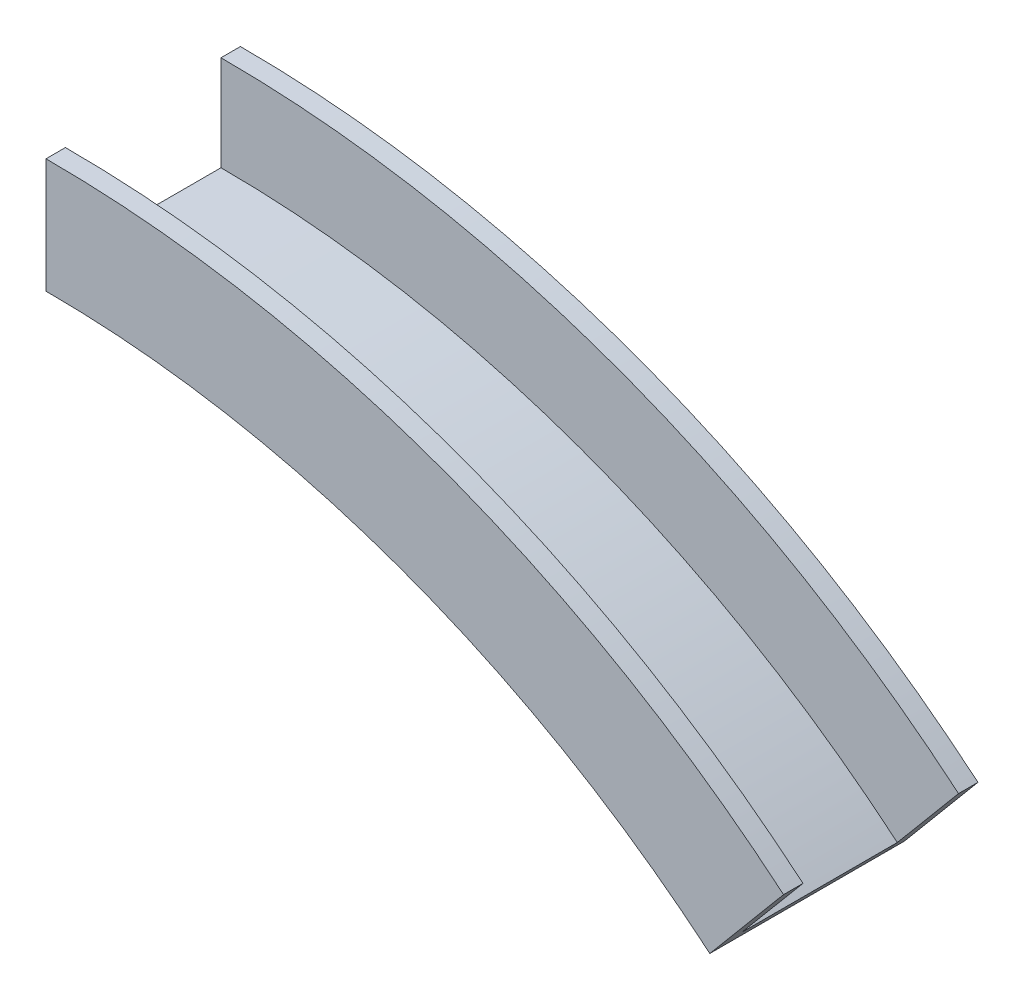
ISO-10303-21;
HEADER;
FILE_DESCRIPTION(('STEP AP214'),'2;1');
FILE_NAME('part.step','',(''),(''),'','','');
FILE_SCHEMA(('AUTOMOTIVE_DESIGN { 1 0 10303 214 1 1 1 1 }'));
ENDSEC;
DATA;
#1=APPLICATION_CONTEXT('core data for automotive mechanical design processes');
#2=APPLICATION_PROTOCOL_DEFINITION('international standard','automotive_design',2000,#1);
#3=PRODUCT_CONTEXT('',#1,'mechanical');
#4=PRODUCT('Part','Part','',(#3));
#5=PRODUCT_RELATED_PRODUCT_CATEGORY('part','',(#4));
#6=PRODUCT_DEFINITION_FORMATION('','',#4);
#7=PRODUCT_DEFINITION_CONTEXT('part definition',#1,'design');
#8=PRODUCT_DEFINITION('design','',#6,#7);
#9=PRODUCT_DEFINITION_SHAPE('','',#8);
#10=(LENGTH_UNIT() NAMED_UNIT(*) SI_UNIT(.MILLI.,.METRE.));
#11=(NAMED_UNIT(*) PLANE_ANGLE_UNIT() SI_UNIT($,.RADIAN.));
#12=(NAMED_UNIT(*) SI_UNIT($,.STERADIAN.) SOLID_ANGLE_UNIT());
#13=UNCERTAINTY_MEASURE_WITH_UNIT(LENGTH_MEASURE(1.E-05),#10,'distance_accuracy_value','');
#14=(GEOMETRIC_REPRESENTATION_CONTEXT(3) GLOBAL_UNCERTAINTY_ASSIGNED_CONTEXT((#13)) GLOBAL_UNIT_ASSIGNED_CONTEXT((#10,
#11,#12)) REPRESENTATION_CONTEXT('',''));
#15=CARTESIAN_POINT('',(0.,0.,0.));
#16=DIRECTION('',(0.,0.,1.));
#17=DIRECTION('',(1.,0.,0.));
#18=AXIS2_PLACEMENT_3D('',#15,#16,#17);
#19=CARTESIAN_POINT('',(0.,0.,3.175));
#20=DIRECTION('',(0.,0.,1.));
#21=DIRECTION('',(1.,0.,0.));
#22=AXIS2_PLACEMENT_3D('',#19,#20,#21);
#23=PLANE('',#22);
#24=CARTESIAN_POINT('',(0.,0.,3.175));
#25=DIRECTION('',(0.,0.,1.));
#26=DIRECTION('',(1.,0.,0.));
#27=AXIS2_PLACEMENT_3D('',#24,#25,#26);
#28=CIRCLE('',#27,168.656);
#29=CARTESIAN_POINT('',(108.409987099295,129.197991598673,3.175));
#30=VERTEX_POINT('',#29);
#31=CARTESIAN_POINT('',(0.,168.656,3.175));
#32=VERTEX_POINT('',#31);
#33=EDGE_CURVE('E88',#30,#32,#28,.T.);
#34=ORIENTED_EDGE('',*,*,#33,.F.);
#35=DIRECTION('',(0.642787609686557,0.766044443118963,0.));
#36=VECTOR('',#35,1.);
#37=CARTESIAN_POINT('',(-8.39849176403869E-13,7.04717134165062E-13,3.175));
#38=LINE('',#37,#36);
#39=CARTESIAN_POINT('',(120.451005997749,143.547919129398,3.175));
#40=VERTEX_POINT('',#39);
#41=EDGE_CURVE('E91',#30,#40,#38,.T.);
#42=ORIENTED_EDGE('',*,*,#41,.T.);
#43=CARTESIAN_POINT('',(0.,0.,3.175));
#44=DIRECTION('',(0.,0.,1.));
#45=DIRECTION('',(1.,0.,0.));
#46=AXIS2_PLACEMENT_3D('',#43,#44,#45);
#47=CIRCLE('',#46,187.3885);
#48=CARTESIAN_POINT('',(0.,187.3885,3.175));
#49=VERTEX_POINT('',#48);
#50=EDGE_CURVE('E66',#40,#49,#47,.T.);
#51=ORIENTED_EDGE('',*,*,#50,.T.);
#52=DIRECTION('',(0.,1.,0.));
#53=VECTOR('',#52,1.);
#54=CARTESIAN_POINT('',(0.,0.,3.175));
#55=LINE('',#54,#53);
#56=EDGE_CURVE('E86',#32,#49,#55,.T.);
#57=ORIENTED_EDGE('',*,*,#56,.F.);
#58=EDGE_LOOP('',(#34,#42,#51,#57));
#59=FACE_BOUND('',#58,.T.);
#60=ADVANCED_FACE('F44',(#59),#23,.T.);
#61=CARTESIAN_POINT('',(0.,49.6794513874194,-0.01));
#62=DIRECTION('',(1.,0.,0.));
#63=DIRECTION('',(0.,1.,0.));
#64=AXIS2_PLACEMENT_3D('',#61,#62,#63);
#65=PLANE('',#64);
#66=DIRECTION('',(0.,0.,-1.));
#67=VECTOR('',#66,1.);
#68=CARTESIAN_POINT('',(0.,168.656,3.175));
#69=LINE('',#68,#67);
#70=CARTESIAN_POINT('',(0.,168.656,0.));
#71=VERTEX_POINT('',#70);
#72=EDGE_CURVE('E12',#71,#32,#69,.F.);
#73=ORIENTED_EDGE('',*,*,#72,.T.);
#74=ORIENTED_EDGE('',*,*,#56,.T.);
#75=DIRECTION('',(0.,0.,-1.));
#76=VECTOR('',#75,1.);
#77=CARTESIAN_POINT('',(0.,187.3885,3.175));
#78=LINE('',#77,#76);
#79=CARTESIAN_POINT('',(0.,187.3885,0.));
#80=VERTEX_POINT('',#79);
#81=EDGE_CURVE('E122',#80,#49,#78,.F.);
#82=ORIENTED_EDGE('',*,*,#81,.F.);
#83=DIRECTION('',(0.,1.,0.));
#84=VECTOR('',#83,1.);
#85=CARTESIAN_POINT('',(0.,0.,0.));
#86=LINE('',#85,#84);
#87=EDGE_CURVE('E58',#71,#80,#86,.T.);
#88=ORIENTED_EDGE('',*,*,#87,.F.);
#89=EDGE_LOOP('',(#73,#74,#82,#88));
#90=FACE_BOUND('',#89,.T.);
#91=ADVANCED_FACE('F99',(#90),#65,.F.);
#92=CARTESIAN_POINT('',(0.,0.,0.));
#93=DIRECTION('',(0.,0.,1.));
#94=DIRECTION('',(1.,0.,0.));
#95=AXIS2_PLACEMENT_3D('',#92,#93,#94);
#96=PLANE('',#95);
#97=DIRECTION('',(0.642787609686557,0.766044443118963,0.));
#98=VECTOR('',#97,1.);
#99=CARTESIAN_POINT('',(-8.39849176403869E-13,7.04717134165062E-13,0.));
#100=LINE('',#99,#98);
#101=CARTESIAN_POINT('',(108.409987099295,129.197991598673,0.));
#102=VERTEX_POINT('',#101);
#103=CARTESIAN_POINT('',(120.451005997749,143.547919129398,0.));
#104=VERTEX_POINT('',#103);
#105=EDGE_CURVE('E90',#102,#104,#100,.T.);
#106=ORIENTED_EDGE('',*,*,#105,.F.);
#107=CARTESIAN_POINT('',(0.,0.,0.));
#108=DIRECTION('',(0.,0.,1.));
#109=DIRECTION('',(1.,0.,0.));
#110=AXIS2_PLACEMENT_3D('',#107,#108,#109);
#111=CIRCLE('',#110,168.656);
#112=EDGE_CURVE('E97',#102,#71,#111,.T.);
#113=ORIENTED_EDGE('',*,*,#112,.T.);
#114=ORIENTED_EDGE('',*,*,#87,.T.);
#115=CARTESIAN_POINT('',(0.,0.,0.));
#116=DIRECTION('',(0.,0.,1.));
#117=DIRECTION('',(1.,0.,0.));
#118=AXIS2_PLACEMENT_3D('',#115,#116,#117);
#119=CIRCLE('',#118,187.3885);
#120=EDGE_CURVE('E126',#104,#80,#119,.T.);
#121=ORIENTED_EDGE('',*,*,#120,.F.);
#122=EDGE_LOOP('',(#106,#113,#114,#121));
#123=FACE_BOUND('',#122,.T.);
#124=ADVANCED_FACE('F101',(#123),#96,.F.);
#125=CARTESIAN_POINT('',(31.933335807858,38.056667672532,-0.01));
#126=DIRECTION('',(0.766044443118963,-0.642787609686557,0.));
#127=DIRECTION('',(0.642787609686557,0.766044443118963,0.));
#128=AXIS2_PLACEMENT_3D('',#125,#126,#127);
#129=PLANE('',#128);
#130=ORIENTED_EDGE('',*,*,#41,.F.);
#131=DIRECTION('',(0.,0.,-1.));
#132=VECTOR('',#131,1.);
#133=CARTESIAN_POINT('',(108.409987099295,129.197991598673,3.175));
#134=LINE('',#133,#132);
#135=EDGE_CURVE('E96',#102,#30,#134,.F.);
#136=ORIENTED_EDGE('',*,*,#135,.F.);
#137=ORIENTED_EDGE('',*,*,#105,.T.);
#138=DIRECTION('',(0.,0.,-1.));
#139=VECTOR('',#138,1.);
#140=CARTESIAN_POINT('',(120.451005997749,143.547919129398,3.175));
#141=LINE('',#140,#139);
#142=EDGE_CURVE('E52',#104,#40,#141,.F.);
#143=ORIENTED_EDGE('',*,*,#142,.T.);
#144=EDGE_LOOP('',(#130,#136,#137,#143));
#145=FACE_BOUND('',#144,.T.);
#146=ADVANCED_FACE('F107',(#145),#129,.T.);
#147=CARTESIAN_POINT('',(0.,0.,3.175));
#148=DIRECTION('',(0.,0.,-1.));
#149=DIRECTION('',(-1.,0.,0.));
#150=AXIS2_PLACEMENT_3D('',#147,#148,#149);
#151=CYLINDRICAL_SURFACE('',#150,187.3885);
#152=ORIENTED_EDGE('',*,*,#142,.F.);
#153=ORIENTED_EDGE('',*,*,#120,.T.);
#154=ORIENTED_EDGE('',*,*,#81,.T.);
#155=ORIENTED_EDGE('',*,*,#50,.F.);
#156=EDGE_LOOP('',(#152,#153,#154,#155));
#157=FACE_BOUND('',#156,.T.);
#158=ADVANCED_FACE('F112',(#157),#151,.T.);
#159=CARTESIAN_POINT('',(0.,0.,3.175));
#160=DIRECTION('',(0.,0.,-1.));
#161=DIRECTION('',(-1.,0.,0.));
#162=AXIS2_PLACEMENT_3D('',#159,#160,#161);
#163=CYLINDRICAL_SURFACE('',#162,168.656);
#164=ORIENTED_EDGE('',*,*,#135,.T.);
#165=ORIENTED_EDGE('',*,*,#33,.T.);
#166=ORIENTED_EDGE('',*,*,#72,.F.);
#167=ORIENTED_EDGE('',*,*,#112,.F.);
#168=EDGE_LOOP('',(#164,#165,#166,#167));
#169=FACE_BOUND('',#168,.T.);
#170=ADVANCED_FACE('F46',(#169),#163,.F.);
#171=CLOSED_SHELL('',(#60,#91,#124,#146,#158,#170));
#172=MANIFOLD_SOLID_BREP('B2',#171);
#173=CARTESIAN_POINT('',(0.,0.,3.175));
#174=DIRECTION('',(0.,0.,1.));
#175=DIRECTION('',(1.,0.,0.));
#176=AXIS2_PLACEMENT_3D('',#173,#174,#175);
#177=PLANE('',#176);
#178=CARTESIAN_POINT('',(0.,0.,3.175));
#179=DIRECTION('',(0.,0.,1.));
#180=DIRECTION('',(1.,0.,0.));
#181=AXIS2_PLACEMENT_3D('',#178,#179,#180);
#182=CIRCLE('',#181,171.831);
#183=CARTESIAN_POINT('',(110.45083776005,131.630182705575,3.175));
#184=VERTEX_POINT('',#183);
#185=CARTESIAN_POINT('',(0.,171.831,3.175));
#186=VERTEX_POINT('',#185);
#187=EDGE_CURVE('E238',#184,#186,#182,.T.);
#188=ORIENTED_EDGE('',*,*,#187,.F.);
#189=DIRECTION('',(-0.642787609686557,-0.766044443118963,0.));
#190=VECTOR('',#189,1.);
#191=CARTESIAN_POINT('',(31.933335807858,38.056667672532,3.175));
#192=LINE('',#191,#190);
#193=CARTESIAN_POINT('',(108.409987099295,129.197991598673,3.175));
#194=VERTEX_POINT('',#193);
#195=EDGE_CURVE('E184',#184,#194,#192,.T.);
#196=ORIENTED_EDGE('',*,*,#195,.T.);
#197=CARTESIAN_POINT('',(0.,0.,3.175));
#198=DIRECTION('',(0.,0.,1.));
#199=DIRECTION('',(1.,0.,0.));
#200=AXIS2_PLACEMENT_3D('',#197,#198,#199);
#201=CIRCLE('',#200,168.656);
#202=CARTESIAN_POINT('',(0.,168.656,3.175));
#203=VERTEX_POINT('',#202);
#204=EDGE_CURVE('E42',#194,#203,#201,.T.);
#205=ORIENTED_EDGE('',*,*,#204,.T.);
#206=DIRECTION('',(0.,-1.,0.));
#207=VECTOR('',#206,1.);
#208=CARTESIAN_POINT('',(0.,49.6794513874194,3.175));
#209=LINE('',#208,#207);
#210=EDGE_CURVE('E179',#186,#203,#209,.T.);
#211=ORIENTED_EDGE('',*,*,#210,.F.);
#212=EDGE_LOOP('',(#188,#196,#205,#211));
#213=FACE_BOUND('',#212,.T.);
#214=ADVANCED_FACE('F176',(#213),#177,.F.);
#215=CARTESIAN_POINT('',(0.,49.6794513874194,-0.01));
#216=DIRECTION('',(1.,0.,0.));
#217=DIRECTION('',(0.,1.,0.));
#218=AXIS2_PLACEMENT_3D('',#215,#216,#217);
#219=PLANE('',#218);
#220=DIRECTION('',(0.,0.,-1.));
#221=VECTOR('',#220,1.);
#222=CARTESIAN_POINT('',(0.,171.831,28.575));
#223=LINE('',#222,#221);
#224=CARTESIAN_POINT('',(0.,171.831,28.575));
#225=VERTEX_POINT('',#224);
#226=EDGE_CURVE('E249',#186,#225,#223,.F.);
#227=ORIENTED_EDGE('',*,*,#226,.F.);
#228=ORIENTED_EDGE('',*,*,#210,.T.);
#229=DIRECTION('',(0.,0.,-1.));
#230=VECTOR('',#229,1.);
#231=CARTESIAN_POINT('',(0.,168.656,3.175));
#232=LINE('',#231,#230);
#233=CARTESIAN_POINT('',(0.,168.656,31.75));
#234=VERTEX_POINT('',#233);
#235=EDGE_CURVE('E272',#203,#234,#232,.F.);
#236=ORIENTED_EDGE('',*,*,#235,.T.);
#237=DIRECTION('',(0.,1.,0.));
#238=VECTOR('',#237,1.);
#239=CARTESIAN_POINT('',(0.,0.,31.75));
#240=LINE('',#239,#238);
#241=CARTESIAN_POINT('',(0.,187.3885,31.75));
#242=VERTEX_POINT('',#241);
#243=EDGE_CURVE('E257',#234,#242,#240,.T.);
#244=ORIENTED_EDGE('',*,*,#243,.T.);
#245=DIRECTION('',(0.,0.,-1.));
#246=VECTOR('',#245,1.);
#247=CARTESIAN_POINT('',(0.,187.3885,31.75));
#248=LINE('',#247,#246);
#249=CARTESIAN_POINT('',(0.,187.3885,28.575));
#250=VERTEX_POINT('',#249);
#251=EDGE_CURVE('E233',#250,#242,#248,.F.);
#252=ORIENTED_EDGE('',*,*,#251,.F.);
#253=DIRECTION('',(0.,1.,0.));
#254=VECTOR('',#253,1.);
#255=CARTESIAN_POINT('',(0.,0.,28.575));
#256=LINE('',#255,#254);
#257=EDGE_CURVE('E248',#225,#250,#256,.T.);
#258=ORIENTED_EDGE('',*,*,#257,.F.);
#259=EDGE_LOOP('',(#227,#228,#236,#244,#252,#258));
#260=FACE_BOUND('',#259,.T.);
#261=ADVANCED_FACE('F278',(#260),#219,.F.);
#262=CARTESIAN_POINT('',(31.933335807858,38.056667672532,-0.01));
#263=DIRECTION('',(0.766044443118963,-0.642787609686557,0.));
#264=DIRECTION('',(0.642787609686557,0.766044443118963,0.));
#265=AXIS2_PLACEMENT_3D('',#262,#263,#264);
#266=PLANE('',#265);
#267=ORIENTED_EDGE('',*,*,#195,.F.);
#268=DIRECTION('',(0.,0.,-1.));
#269=VECTOR('',#268,1.);
#270=CARTESIAN_POINT('',(110.45083776005,131.630182705575,28.575));
#271=LINE('',#270,#269);
#272=CARTESIAN_POINT('',(110.45083776005,131.630182705575,28.575));
#273=VERTEX_POINT('',#272);
#274=EDGE_CURVE('E275',#184,#273,#271,.F.);
#275=ORIENTED_EDGE('',*,*,#274,.T.);
#276=DIRECTION('',(0.642787609686557,0.766044443118963,0.));
#277=VECTOR('',#276,1.);
#278=CARTESIAN_POINT('',(-8.39849176403869E-13,7.04717134165062E-13,28.575));
#279=LINE('',#278,#277);
#280=CARTESIAN_POINT('',(120.451005997749,143.547919129398,28.575));
#281=VERTEX_POINT('',#280);
#282=EDGE_CURVE('E255',#273,#281,#279,.T.);
#283=ORIENTED_EDGE('',*,*,#282,.T.);
#284=DIRECTION('',(0.,0.,-1.));
#285=VECTOR('',#284,1.);
#286=CARTESIAN_POINT('',(120.451005997749,143.547919129398,31.75));
#287=LINE('',#286,#285);
#288=CARTESIAN_POINT('',(120.451005997749,143.547919129398,31.75));
#289=VERTEX_POINT('',#288);
#290=EDGE_CURVE('E231',#281,#289,#287,.F.);
#291=ORIENTED_EDGE('',*,*,#290,.T.);
#292=DIRECTION('',(0.642787609686557,0.766044443118963,0.));
#293=VECTOR('',#292,1.);
#294=CARTESIAN_POINT('',(-8.39849176403869E-13,7.04717134165062E-13,31.75));
#295=LINE('',#294,#293);
#296=CARTESIAN_POINT('',(108.409987099295,129.197991598673,31.75));
#297=VERTEX_POINT('',#296);
#298=EDGE_CURVE('E242',#297,#289,#295,.T.);
#299=ORIENTED_EDGE('',*,*,#298,.F.);
#300=DIRECTION('',(0.,0.,-1.));
#301=VECTOR('',#300,1.);
#302=CARTESIAN_POINT('',(108.409987099295,129.197991598673,3.175));
#303=LINE('',#302,#301);
#304=EDGE_CURVE('E271',#194,#297,#303,.F.);
#305=ORIENTED_EDGE('',*,*,#304,.F.);
#306=EDGE_LOOP('',(#267,#275,#283,#291,#299,#305));
#307=FACE_BOUND('',#306,.T.);
#308=ADVANCED_FACE('F252',(#307),#266,.T.);
#309=CARTESIAN_POINT('',(0.,0.,3.175));
#310=DIRECTION('',(0.,0.,-1.));
#311=DIRECTION('',(-1.,0.,0.));
#312=AXIS2_PLACEMENT_3D('',#309,#310,#311);
#313=CYLINDRICAL_SURFACE('',#312,168.656);
#314=ORIENTED_EDGE('',*,*,#204,.F.);
#315=ORIENTED_EDGE('',*,*,#304,.T.);
#316=CARTESIAN_POINT('',(0.,0.,31.75));
#317=DIRECTION('',(0.,0.,1.));
#318=DIRECTION('',(1.,0.,0.));
#319=AXIS2_PLACEMENT_3D('',#316,#317,#318);
#320=CIRCLE('',#319,168.656);
#321=EDGE_CURVE('E245',#297,#234,#320,.T.);
#322=ORIENTED_EDGE('',*,*,#321,.T.);
#323=ORIENTED_EDGE('',*,*,#235,.F.);
#324=EDGE_LOOP('',(#314,#315,#322,#323));
#325=FACE_BOUND('',#324,.T.);
#326=ADVANCED_FACE('F280',(#325),#313,.F.);
#327=CARTESIAN_POINT('',(0.,0.,28.575));
#328=DIRECTION('',(0.,0.,-1.));
#329=DIRECTION('',(-1.,0.,0.));
#330=AXIS2_PLACEMENT_3D('',#327,#328,#329);
#331=CYLINDRICAL_SURFACE('',#330,171.831);
#332=ORIENTED_EDGE('',*,*,#274,.F.);
#333=ORIENTED_EDGE('',*,*,#187,.T.);
#334=ORIENTED_EDGE('',*,*,#226,.T.);
#335=CARTESIAN_POINT('',(0.,0.,28.575));
#336=DIRECTION('',(0.,0.,1.));
#337=DIRECTION('',(1.,0.,0.));
#338=AXIS2_PLACEMENT_3D('',#335,#336,#337);
#339=CIRCLE('',#338,171.831);
#340=EDGE_CURVE('E261',#273,#225,#339,.T.);
#341=ORIENTED_EDGE('',*,*,#340,.F.);
#342=EDGE_LOOP('',(#332,#333,#334,#341));
#343=FACE_BOUND('',#342,.T.);
#344=ADVANCED_FACE('F282',(#343),#331,.T.);
#345=CARTESIAN_POINT('',(0.,0.,31.75));
#346=DIRECTION('',(0.,0.,1.));
#347=DIRECTION('',(1.,0.,0.));
#348=AXIS2_PLACEMENT_3D('',#345,#346,#347);
#349=PLANE('',#348);
#350=ORIENTED_EDGE('',*,*,#321,.F.);
#351=ORIENTED_EDGE('',*,*,#298,.T.);
#352=CARTESIAN_POINT('',(0.,0.,31.75));
#353=DIRECTION('',(0.,0.,1.));
#354=DIRECTION('',(1.,0.,0.));
#355=AXIS2_PLACEMENT_3D('',#352,#353,#354);
#356=CIRCLE('',#355,187.3885);
#357=EDGE_CURVE('E226',#289,#242,#356,.T.);
#358=ORIENTED_EDGE('',*,*,#357,.T.);
#359=ORIENTED_EDGE('',*,*,#243,.F.);
#360=EDGE_LOOP('',(#350,#351,#358,#359));
#361=FACE_BOUND('',#360,.T.);
#362=ADVANCED_FACE('F243',(#361),#349,.T.);
#363=CARTESIAN_POINT('',(0.,0.,28.575));
#364=DIRECTION('',(0.,0.,1.));
#365=DIRECTION('',(1.,0.,0.));
#366=AXIS2_PLACEMENT_3D('',#363,#364,#365);
#367=PLANE('',#366);
#368=ORIENTED_EDGE('',*,*,#282,.F.);
#369=ORIENTED_EDGE('',*,*,#340,.T.);
#370=ORIENTED_EDGE('',*,*,#257,.T.);
#371=CARTESIAN_POINT('',(0.,0.,28.575));
#372=DIRECTION('',(0.,0.,1.));
#373=DIRECTION('',(1.,0.,0.));
#374=AXIS2_PLACEMENT_3D('',#371,#372,#373);
#375=CIRCLE('',#374,187.3885);
#376=EDGE_CURVE('E237',#281,#250,#375,.T.);
#377=ORIENTED_EDGE('',*,*,#376,.F.);
#378=EDGE_LOOP('',(#368,#369,#370,#377));
#379=FACE_BOUND('',#378,.T.);
#380=ADVANCED_FACE('F326',(#379),#367,.F.);
#381=CARTESIAN_POINT('',(0.,0.,31.75));
#382=DIRECTION('',(0.,0.,-1.));
#383=DIRECTION('',(-1.,0.,0.));
#384=AXIS2_PLACEMENT_3D('',#381,#382,#383);
#385=CYLINDRICAL_SURFACE('',#384,187.3885);
#386=ORIENTED_EDGE('',*,*,#290,.F.);
#387=ORIENTED_EDGE('',*,*,#376,.T.);
#388=ORIENTED_EDGE('',*,*,#251,.T.);
#389=ORIENTED_EDGE('',*,*,#357,.F.);
#390=EDGE_LOOP('',(#386,#387,#388,#389));
#391=FACE_BOUND('',#390,.T.);
#392=ADVANCED_FACE('F228',(#391),#385,.T.);
#393=CLOSED_SHELL('',(#214,#261,#308,#326,#344,#362,#380,#392));
#394=MANIFOLD_SOLID_BREP('B6',#393);
#395=ADVANCED_BREP_SHAPE_REPRESENTATION('',(#18,#172,#394),#14);
#396=SHAPE_DEFINITION_REPRESENTATION(#9,#395);
ENDSEC;
END-ISO-10303-21;
